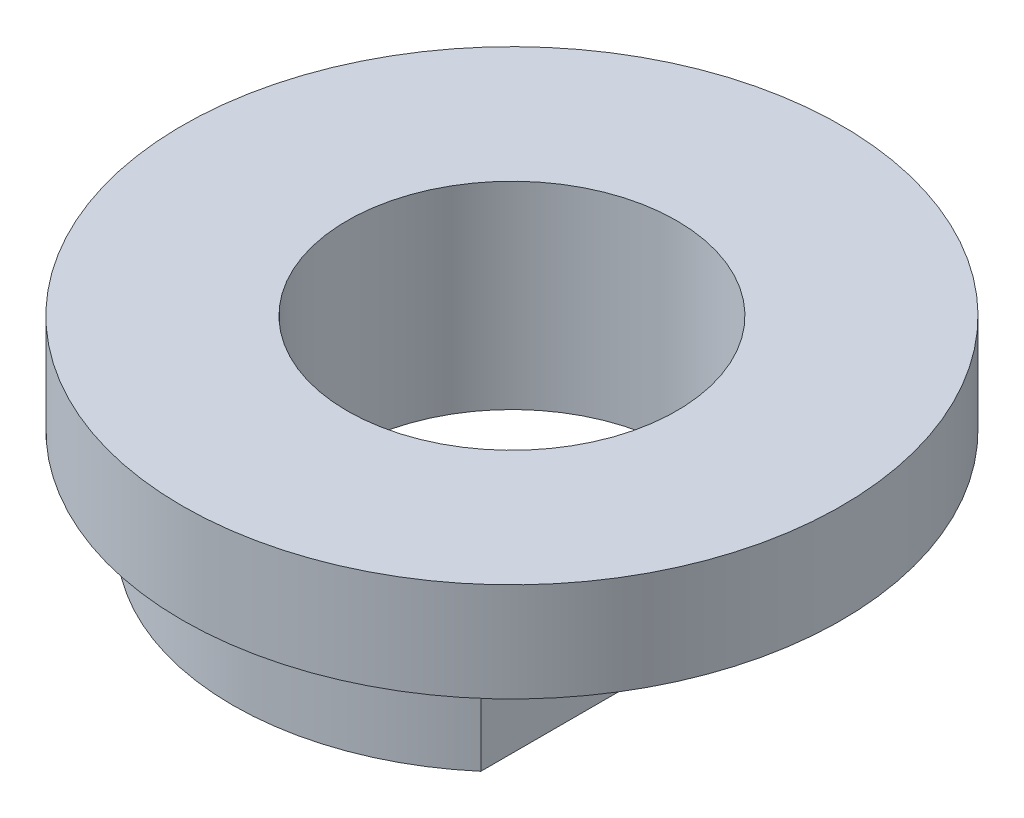
ISO-10303-21;
HEADER;
FILE_DESCRIPTION(('STEP AP214'),'2;1');
FILE_NAME('part.step','',(''),(''),'','','');
FILE_SCHEMA(('AUTOMOTIVE_DESIGN { 1 0 10303 214 1 1 1 1 }'));
ENDSEC;
DATA;
#1=APPLICATION_CONTEXT('core data for automotive mechanical design processes');
#2=APPLICATION_PROTOCOL_DEFINITION('international standard','automotive_design',2000,#1);
#3=PRODUCT_CONTEXT('',#1,'mechanical');
#4=PRODUCT('Part','Part','',(#3));
#5=PRODUCT_RELATED_PRODUCT_CATEGORY('part','',(#4));
#6=PRODUCT_DEFINITION_FORMATION('','',#4);
#7=PRODUCT_DEFINITION_CONTEXT('part definition',#1,'design');
#8=PRODUCT_DEFINITION('design','',#6,#7);
#9=PRODUCT_DEFINITION_SHAPE('','',#8);
#10=(LENGTH_UNIT() NAMED_UNIT(*) SI_UNIT(.MILLI.,.METRE.));
#11=(NAMED_UNIT(*) PLANE_ANGLE_UNIT() SI_UNIT($,.RADIAN.));
#12=(NAMED_UNIT(*) SI_UNIT($,.STERADIAN.) SOLID_ANGLE_UNIT());
#13=UNCERTAINTY_MEASURE_WITH_UNIT(LENGTH_MEASURE(1.E-05),#10,'distance_accuracy_value','');
#14=(GEOMETRIC_REPRESENTATION_CONTEXT(3) GLOBAL_UNCERTAINTY_ASSIGNED_CONTEXT((#13)) GLOBAL_UNIT_ASSIGNED_CONTEXT((#10,
#11,#12)) REPRESENTATION_CONTEXT('',''));
#15=CARTESIAN_POINT('',(0.,0.,0.));
#16=DIRECTION('',(0.,0.,1.));
#17=DIRECTION('',(1.,0.,0.));
#18=AXIS2_PLACEMENT_3D('',#15,#16,#17);
#19=CARTESIAN_POINT('',(-276.039395260259,0.,-222.846937384017));
#20=DIRECTION('',(0.,-1.,0.));
#21=DIRECTION('',(0.,0.,-1.));
#22=AXIS2_PLACEMENT_3D('',#19,#20,#21);
#23=PLANE('',#22);
#24=CARTESIAN_POINT('',(-276.039395260259,0.,-222.846937384017));
#25=DIRECTION('',(0.,1.,0.));
#26=DIRECTION('',(0.,0.,-1.));
#27=AXIS2_PLACEMENT_3D('',#24,#25,#26);
#28=CIRCLE('',#27,8.40591782941927);
#29=CARTESIAN_POINT('',(-270.539395260259,0.,-229.203780512091));
#30=VERTEX_POINT('',#29);
#31=CARTESIAN_POINT('',(-281.539395260259,0.,-229.203780512091));
#32=VERTEX_POINT('',#31);
#33=EDGE_CURVE('E107',#30,#32,#28,.T.);
#34=ORIENTED_EDGE('',*,*,#33,.F.);
#35=DIRECTION('',(0.,0.,-1.));
#36=VECTOR('',#35,1.);
#37=CARTESIAN_POINT('',(-270.539395260259,0.,-229.203780512091));
#38=LINE('',#37,#36);
#39=CARTESIAN_POINT('',(-270.539395260259,0.,-216.403780512091));
#40=VERTEX_POINT('',#39);
#41=EDGE_CURVE('E79',#40,#30,#38,.T.);
#42=ORIENTED_EDGE('',*,*,#41,.F.);
#43=CARTESIAN_POINT('',(-276.039395260259,0.,-222.846937384017));
#44=DIRECTION('',(0.,1.,0.));
#45=DIRECTION('',(0.,0.,1.));
#46=AXIS2_PLACEMENT_3D('',#43,#44,#45);
#47=CIRCLE('',#46,8.47137949074648);
#48=CARTESIAN_POINT('',(-281.539395260259,0.,-216.403780512091));
#49=VERTEX_POINT('',#48);
#50=EDGE_CURVE('E74',#49,#40,#47,.T.);
#51=ORIENTED_EDGE('',*,*,#50,.F.);
#52=DIRECTION('',(0.,0.,1.));
#53=VECTOR('',#52,1.);
#54=CARTESIAN_POINT('',(-281.539395260259,0.,-229.203780512091));
#55=LINE('',#54,#53);
#56=EDGE_CURVE('E109',#32,#49,#55,.T.);
#57=ORIENTED_EDGE('',*,*,#56,.F.);
#58=EDGE_LOOP('',(#34,#42,#51,#57));
#59=FACE_BOUND('',#58,.T.);
#60=CARTESIAN_POINT('',(-276.039395260259,0.,-222.846937384017));
#61=DIRECTION('',(0.,1.,0.));
#62=DIRECTION('',(0.,0.,1.));
#63=AXIS2_PLACEMENT_3D('',#60,#61,#62);
#64=CIRCLE('',#63,4.99999999999999);
#65=CARTESIAN_POINT('',(-276.039395260259,0.,-217.846937384017));
#66=VERTEX_POINT('',#65);
#67=EDGE_CURVE('E110',#66,#66,#64,.T.);
#68=ORIENTED_EDGE('',*,*,#67,.T.);
#69=EDGE_LOOP('',(#68));
#70=FACE_BOUND('',#69,.T.);
#71=ADVANCED_FACE('F41',(#59,#70),#23,.T.);
#72=CARTESIAN_POINT('',(-276.039395260259,3.,-222.846937384017));
#73=DIRECTION('',(0.,-1.,0.));
#74=DIRECTION('',(0.,0.,-1.));
#75=AXIS2_PLACEMENT_3D('',#72,#73,#74);
#76=CYLINDRICAL_SURFACE('',#75,8.40591782941927);
#77=ORIENTED_EDGE('',*,*,#33,.T.);
#78=DIRECTION('',(0.,-1.,0.));
#79=VECTOR('',#78,1.);
#80=CARTESIAN_POINT('',(-281.539395260259,3.,-229.203780512091));
#81=LINE('',#80,#79);
#82=CARTESIAN_POINT('',(-281.539395260259,3.,-229.203780512091));
#83=VERTEX_POINT('',#82);
#84=EDGE_CURVE('E11',#83,#32,#81,.T.);
#85=ORIENTED_EDGE('',*,*,#84,.F.);
#86=CARTESIAN_POINT('',(-276.039395260259,3.,-222.846937384017));
#87=DIRECTION('',(0.,1.,0.));
#88=DIRECTION('',(0.,0.,-1.));
#89=AXIS2_PLACEMENT_3D('',#86,#87,#88);
#90=CIRCLE('',#89,8.40591782941927);
#91=CARTESIAN_POINT('',(-270.539395260259,3.,-229.203780512091));
#92=VERTEX_POINT('',#91);
#93=EDGE_CURVE('E90',#92,#83,#90,.T.);
#94=ORIENTED_EDGE('',*,*,#93,.F.);
#95=DIRECTION('',(0.,-1.,0.));
#96=VECTOR('',#95,1.);
#97=CARTESIAN_POINT('',(-270.539395260259,3.,-229.203780512091));
#98=LINE('',#97,#96);
#99=EDGE_CURVE('E92',#92,#30,#98,.T.);
#100=ORIENTED_EDGE('',*,*,#99,.T.);
#101=EDGE_LOOP('',(#77,#85,#94,#100));
#102=FACE_BOUND('',#101,.T.);
#103=ADVANCED_FACE('F43',(#102),#76,.T.);
#104=CARTESIAN_POINT('',(-281.539395260259,3.,-229.203780512091));
#105=DIRECTION('',(1.,0.,0.));
#106=DIRECTION('',(0.,0.,-1.));
#107=AXIS2_PLACEMENT_3D('',#104,#105,#106);
#108=PLANE('',#107);
#109=ORIENTED_EDGE('',*,*,#56,.T.);
#110=DIRECTION('',(0.,-1.,0.));
#111=VECTOR('',#110,1.);
#112=CARTESIAN_POINT('',(-281.539395260259,3.,-216.403780512091));
#113=LINE('',#112,#111);
#114=CARTESIAN_POINT('',(-281.539395260259,3.,-216.403780512091));
#115=VERTEX_POINT('',#114);
#116=EDGE_CURVE('E50',#115,#49,#113,.T.);
#117=ORIENTED_EDGE('',*,*,#116,.F.);
#118=DIRECTION('',(0.,0.,1.));
#119=VECTOR('',#118,1.);
#120=CARTESIAN_POINT('',(-281.539395260259,3.,-229.203780512091));
#121=LINE('',#120,#119);
#122=EDGE_CURVE('E84',#83,#115,#121,.T.);
#123=ORIENTED_EDGE('',*,*,#122,.F.);
#124=ORIENTED_EDGE('',*,*,#84,.T.);
#125=EDGE_LOOP('',(#109,#117,#123,#124));
#126=FACE_BOUND('',#125,.T.);
#127=ADVANCED_FACE('F117',(#126),#108,.F.);
#128=CARTESIAN_POINT('',(-276.039395260259,3.,-222.846937384017));
#129=DIRECTION('',(0.,-1.,0.));
#130=DIRECTION('',(0.,0.,-1.));
#131=AXIS2_PLACEMENT_3D('',#128,#129,#130);
#132=CYLINDRICAL_SURFACE('',#131,8.47137949074648);
#133=ORIENTED_EDGE('',*,*,#50,.T.);
#134=DIRECTION('',(0.,-1.,0.));
#135=VECTOR('',#134,1.);
#136=CARTESIAN_POINT('',(-270.539395260259,3.,-216.403780512091));
#137=LINE('',#136,#135);
#138=CARTESIAN_POINT('',(-270.539395260259,3.,-216.403780512091));
#139=VERTEX_POINT('',#138);
#140=EDGE_CURVE('E58',#139,#40,#137,.T.);
#141=ORIENTED_EDGE('',*,*,#140,.F.);
#142=CARTESIAN_POINT('',(-276.039395260259,3.,-222.846937384017));
#143=DIRECTION('',(0.,1.,0.));
#144=DIRECTION('',(0.,0.,1.));
#145=AXIS2_PLACEMENT_3D('',#142,#143,#144);
#146=CIRCLE('',#145,8.47137949074648);
#147=EDGE_CURVE('E102',#115,#139,#146,.T.);
#148=ORIENTED_EDGE('',*,*,#147,.F.);
#149=ORIENTED_EDGE('',*,*,#116,.T.);
#150=EDGE_LOOP('',(#133,#141,#148,#149));
#151=FACE_BOUND('',#150,.T.);
#152=ADVANCED_FACE('F114',(#151),#132,.T.);
#153=CARTESIAN_POINT('',(-270.539395260259,3.,-229.203780512091));
#154=DIRECTION('',(-1.,0.,0.));
#155=DIRECTION('',(0.,0.,1.));
#156=AXIS2_PLACEMENT_3D('',#153,#154,#155);
#157=PLANE('',#156);
#158=ORIENTED_EDGE('',*,*,#41,.T.);
#159=ORIENTED_EDGE('',*,*,#99,.F.);
#160=DIRECTION('',(0.,0.,-1.));
#161=VECTOR('',#160,1.);
#162=CARTESIAN_POINT('',(-270.539395260259,3.,-229.203780512091));
#163=LINE('',#162,#161);
#164=EDGE_CURVE('E98',#139,#92,#163,.T.);
#165=ORIENTED_EDGE('',*,*,#164,.F.);
#166=ORIENTED_EDGE('',*,*,#140,.T.);
#167=EDGE_LOOP('',(#158,#159,#165,#166));
#168=FACE_BOUND('',#167,.T.);
#169=ADVANCED_FACE('F97',(#168),#157,.F.);
#170=CARTESIAN_POINT('',(-276.039395260259,3.,-222.846937384017));
#171=DIRECTION('',(0.,-1.,0.));
#172=DIRECTION('',(0.,0.,-1.));
#173=AXIS2_PLACEMENT_3D('',#170,#171,#172);
#174=CYLINDRICAL_SURFACE('',#173,4.99999999999999);
#175=ORIENTED_EDGE('',*,*,#67,.F.);
#176=EDGE_LOOP('',(#175));
#177=FACE_BOUND('',#176,.T.);
#178=CARTESIAN_POINT('',(-276.039395260259,6.,-222.846937384017));
#179=DIRECTION('',(0.,1.,0.));
#180=DIRECTION('',(0.,0.,1.));
#181=AXIS2_PLACEMENT_3D('',#178,#179,#180);
#182=CIRCLE('',#181,4.99999999999999);
#183=CARTESIAN_POINT('',(-276.039395260259,6.,-217.846937384017));
#184=VERTEX_POINT('',#183);
#185=EDGE_CURVE('E148',#184,#184,#182,.T.);
#186=ORIENTED_EDGE('',*,*,#185,.T.);
#187=EDGE_LOOP('',(#186));
#188=FACE_BOUND('',#187,.T.);
#189=ADVANCED_FACE('F130',(#177,#188),#174,.F.);
#190=CARTESIAN_POINT('',(-276.039395260259,3.,-222.846937384017));
#191=DIRECTION('',(0.,1.,0.));
#192=DIRECTION('',(0.,0.,1.));
#193=AXIS2_PLACEMENT_3D('',#190,#191,#192);
#194=PLANE('',#193);
#195=CARTESIAN_POINT('',(-276.039395260259,3.,-222.846937384017));
#196=DIRECTION('',(0.,1.,0.));
#197=DIRECTION('',(0.,0.,1.));
#198=AXIS2_PLACEMENT_3D('',#195,#196,#197);
#199=CIRCLE('',#198,10.);
#200=CARTESIAN_POINT('',(-276.039395260259,3.,-212.846937384017));
#201=VERTEX_POINT('',#200);
#202=EDGE_CURVE('E150',#201,#201,#199,.T.);
#203=ORIENTED_EDGE('',*,*,#202,.F.);
#204=EDGE_LOOP('',(#203));
#205=FACE_BOUND('',#204,.T.);
#206=ORIENTED_EDGE('',*,*,#164,.T.);
#207=ORIENTED_EDGE('',*,*,#93,.T.);
#208=ORIENTED_EDGE('',*,*,#122,.T.);
#209=ORIENTED_EDGE('',*,*,#147,.T.);
#210=EDGE_LOOP('',(#206,#207,#208,#209));
#211=FACE_BOUND('',#210,.T.);
#212=ADVANCED_FACE('F101',(#205,#211),#194,.F.);
#213=CARTESIAN_POINT('',(-276.039395260259,6.,-222.846937384017));
#214=DIRECTION('',(0.,1.,0.));
#215=DIRECTION('',(0.,0.,1.));
#216=AXIS2_PLACEMENT_3D('',#213,#214,#215);
#217=PLANE('',#216);
#218=CARTESIAN_POINT('',(-276.039395260259,6.,-222.846937384017));
#219=DIRECTION('',(0.,1.,0.));
#220=DIRECTION('',(0.,0.,1.));
#221=AXIS2_PLACEMENT_3D('',#218,#219,#220);
#222=CIRCLE('',#221,10.);
#223=CARTESIAN_POINT('',(-276.039395260259,6.,-212.846937384017));
#224=VERTEX_POINT('',#223);
#225=EDGE_CURVE('E153',#224,#224,#222,.T.);
#226=ORIENTED_EDGE('',*,*,#225,.T.);
#227=EDGE_LOOP('',(#226));
#228=FACE_BOUND('',#227,.T.);
#229=ORIENTED_EDGE('',*,*,#185,.F.);
#230=EDGE_LOOP('',(#229));
#231=FACE_BOUND('',#230,.T.);
#232=ADVANCED_FACE('F140',(#228,#231),#217,.T.);
#233=CARTESIAN_POINT('',(-276.039395260259,6.,-222.846937384017));
#234=DIRECTION('',(0.,-1.,0.));
#235=DIRECTION('',(0.,0.,-1.));
#236=AXIS2_PLACEMENT_3D('',#233,#234,#235);
#237=CYLINDRICAL_SURFACE('',#236,10.);
#238=ORIENTED_EDGE('',*,*,#225,.F.);
#239=EDGE_LOOP('',(#238));
#240=FACE_BOUND('',#239,.T.);
#241=ORIENTED_EDGE('',*,*,#202,.T.);
#242=EDGE_LOOP('',(#241));
#243=FACE_BOUND('',#242,.T.);
#244=ADVANCED_FACE('F161',(#240,#243),#237,.T.);
#245=CLOSED_SHELL('',(#71,#103,#127,#152,#169,#189,#212,#232,#244));
#246=MANIFOLD_SOLID_BREP('B2',#245);
#247=ADVANCED_BREP_SHAPE_REPRESENTATION('',(#18,#246),#14);
#248=SHAPE_DEFINITION_REPRESENTATION(#9,#247);
ENDSEC;
END-ISO-10303-21;
